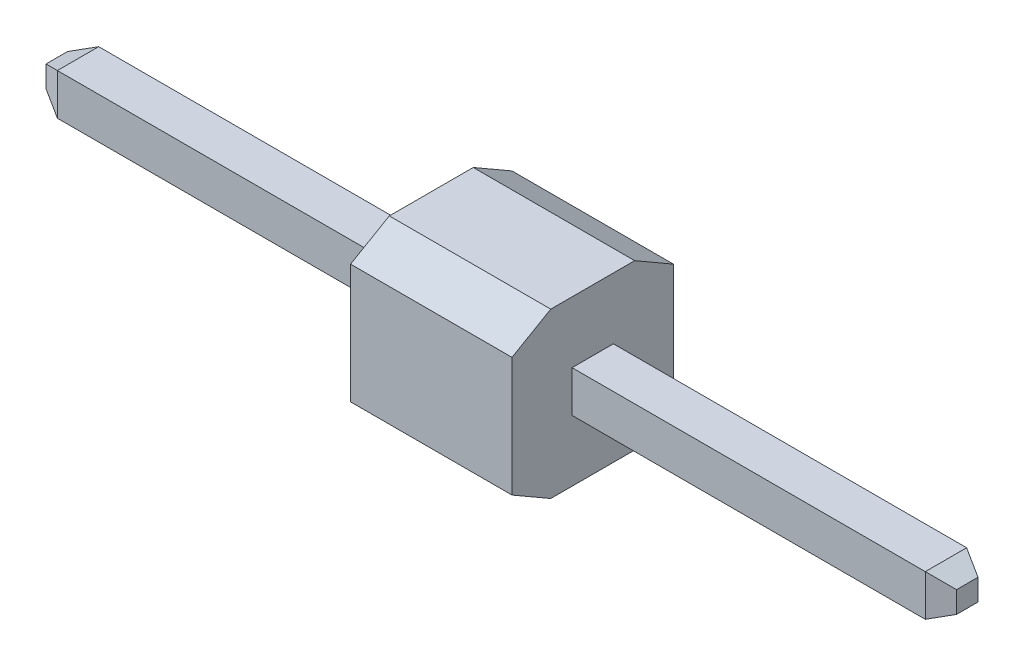
ISO-10303-21;
HEADER;
FILE_DESCRIPTION(('STEP AP214'),'2;1');
FILE_NAME('part.step','',(''),(''),'','','');
FILE_SCHEMA(('AUTOMOTIVE_DESIGN { 1 0 10303 214 1 1 1 1 }'));
ENDSEC;
DATA;
#1=APPLICATION_CONTEXT('core data for automotive mechanical design processes');
#2=APPLICATION_PROTOCOL_DEFINITION('international standard','automotive_design',2000,#1);
#3=PRODUCT_CONTEXT('',#1,'mechanical');
#4=PRODUCT('Part','Part','',(#3));
#5=PRODUCT_RELATED_PRODUCT_CATEGORY('part','',(#4));
#6=PRODUCT_DEFINITION_FORMATION('','',#4);
#7=PRODUCT_DEFINITION_CONTEXT('part definition',#1,'design');
#8=PRODUCT_DEFINITION('design','',#6,#7);
#9=PRODUCT_DEFINITION_SHAPE('','',#8);
#10=(LENGTH_UNIT() NAMED_UNIT(*) SI_UNIT(.MILLI.,.METRE.));
#11=(NAMED_UNIT(*) PLANE_ANGLE_UNIT() SI_UNIT($,.RADIAN.));
#12=(NAMED_UNIT(*) SI_UNIT($,.STERADIAN.) SOLID_ANGLE_UNIT());
#13=UNCERTAINTY_MEASURE_WITH_UNIT(LENGTH_MEASURE(1.E-05),#10,'distance_accuracy_value','');
#14=(GEOMETRIC_REPRESENTATION_CONTEXT(3) GLOBAL_UNCERTAINTY_ASSIGNED_CONTEXT((#13)) GLOBAL_UNIT_ASSIGNED_CONTEXT((#10,
#11,#12)) REPRESENTATION_CONTEXT('',''));
#15=CARTESIAN_POINT('',(0.,0.,0.));
#16=DIRECTION('',(0.,0.,1.));
#17=DIRECTION('',(1.,0.,0.));
#18=AXIS2_PLACEMENT_3D('',#15,#16,#17);
#19=CARTESIAN_POINT('',(5.42107516759986,-5.39712826291391,0.629998634255617));
#20=DIRECTION('',(1.,4.37113882867379E-08,-4.37113882867379E-08));
#21=DIRECTION('',(-4.37113882867379E-08,1.,0.));
#22=AXIS2_PLACEMENT_3D('',#19,#20,#21);
#23=PLANE('',#22);
#24=DIRECTION('',(1.59994777304464E-08,0.500000000000191,0.866025403784328));
#25=VECTOR('',#24,1.);
#26=CARTESIAN_POINT('',(5.42107504461394,-4.15353842442391,-0.940001365744382));
#27=LINE('',#26,#25);
#28=CARTESIAN_POINT('',(5.42107504461394,-4.15353842442391,-0.940001365744382));
#29=VERTEX_POINT('',#28);
#30=CARTESIAN_POINT('',(5.42107505569871,-3.80712826291392,-0.340001365744383));
#31=VERTEX_POINT('',#30);
#32=EDGE_CURVE('E11',#29,#31,#27,.T.);
#33=ORIENTED_EDGE('',*,*,#32,.T.);
#34=DIRECTION('',(4.37113886966664E-08,0.,0.999999999999999));
#35=VECTOR('',#34,1.);
#36=CARTESIAN_POINT('',(5.42107505569871,-3.80712826291392,-0.340001365744383));
#37=LINE('',#36,#35);
#38=CARTESIAN_POINT('',(5.42107511252351,-3.80712826291391,0.959998634255618));
#39=VERTEX_POINT('',#38);
#40=EDGE_CURVE('E304',#31,#39,#37,.T.);
#41=ORIENTED_EDGE('',*,*,#40,.T.);
#42=DIRECTION('',(5.97108668825762E-08,-0.500000000000186,0.866025403784329));
#43=VECTOR('',#42,1.);
#44=CARTESIAN_POINT('',(5.42107511252351,-3.80712826291391,0.959998634255618));
#45=LINE('',#44,#43);
#46=CARTESIAN_POINT('',(5.42107515389241,-4.15353842442391,1.55999863425562));
#47=VERTEX_POINT('',#46);
#48=EDGE_CURVE('E296',#39,#47,#45,.T.);
#49=ORIENTED_EDGE('',*,*,#48,.T.);
#50=DIRECTION('',(4.37113884815545E-08,-0.999999999999999,0.));
#51=VECTOR('',#50,1.);
#52=CARTESIAN_POINT('',(5.42107515389241,-4.15353842442391,1.55999863425562));
#53=LINE('',#52,#51);
#54=CARTESIAN_POINT('',(5.4210752346352,-6.00071810139391,1.55999863425562));
#55=VERTEX_POINT('',#54);
#56=EDGE_CURVE('E281',#47,#55,#53,.T.);
#57=ORIENTED_EDGE('',*,*,#56,.T.);
#58=DIRECTION('',(1.5999479012306E-08,0.500000000000191,0.866025403784328));
#59=VECTOR('',#58,1.);
#60=CARTESIAN_POINT('',(5.42107522355044,-6.34712826291391,0.959998634255618));
#61=LINE('',#60,#59);
#62=CARTESIAN_POINT('',(5.42107522355044,-6.34712826291391,0.959998634255618));
#63=VERTEX_POINT('',#62);
#64=EDGE_CURVE('E265',#63,#55,#61,.T.);
#65=ORIENTED_EDGE('',*,*,#64,.F.);
#66=DIRECTION('',(4.37113886966664E-08,0.,0.999999999999999));
#67=VECTOR('',#66,1.);
#68=CARTESIAN_POINT('',(5.42107516672563,-6.34712826291392,-0.340001365744383));
#69=LINE('',#68,#67);
#70=CARTESIAN_POINT('',(5.42107516672563,-6.34712826291392,-0.340001365744383));
#71=VERTEX_POINT('',#70);
#72=EDGE_CURVE('E248',#71,#63,#69,.T.);
#73=ORIENTED_EDGE('',*,*,#72,.F.);
#74=DIRECTION('',(5.97108656001698E-08,-0.50000000000019,0.866025403784327));
#75=VECTOR('',#74,1.);
#76=CARTESIAN_POINT('',(5.42107512535673,-6.00071810139391,-0.940001365744382));
#77=LINE('',#76,#75);
#78=CARTESIAN_POINT('',(5.42107512535673,-6.00071810139391,-0.940001365744382));
#79=VERTEX_POINT('',#78);
#80=EDGE_CURVE('E242',#79,#71,#77,.T.);
#81=ORIENTED_EDGE('',*,*,#80,.F.);
#82=DIRECTION('',(4.37113884815545E-08,-0.999999999999999,0.));
#83=VECTOR('',#82,1.);
#84=CARTESIAN_POINT('',(5.42107504461394,-4.15353842442391,-0.940001365744382));
#85=LINE('',#84,#83);
#86=EDGE_CURVE('E236',#29,#79,#85,.T.);
#87=ORIENTED_EDGE('',*,*,#86,.F.);
#88=EDGE_LOOP('',(#33,#41,#49,#57,#65,#73,#81,#87));
#89=FACE_BOUND('',#88,.T.);
#90=DIRECTION('',(-4.37113872875372E-08,0.,-0.999999999999999));
#91=VECTOR('',#90,1.);
#92=CARTESIAN_POINT('',(5.42107513962457,-4.75712826291391,0.629998634255617));
#93=LINE('',#92,#91);
#94=CARTESIAN_POINT('',(5.42107513962457,-4.75712826291391,0.629998634255617));
#95=VERTEX_POINT('',#94);
#96=CARTESIAN_POINT('',(5.42107511164928,-4.75712826291391,-0.0100013657443826));
#97=VERTEX_POINT('',#96);
#98=EDGE_CURVE('E302',#95,#97,#93,.T.);
#99=ORIENTED_EDGE('',*,*,#98,.T.);
#100=DIRECTION('',(-4.37113872875371E-08,0.999999999999999,0.));
#101=VECTOR('',#100,1.);
#102=CARTESIAN_POINT('',(5.42107513962457,-5.39712826291391,-0.0100013657443826));
#103=LINE('',#102,#101);
#104=CARTESIAN_POINT('',(5.42107513962457,-5.39712826291391,-0.0100013657443826));
#105=VERTEX_POINT('',#104);
#106=EDGE_CURVE('E293',#105,#97,#103,.T.);
#107=ORIENTED_EDGE('',*,*,#106,.F.);
#108=DIRECTION('',(-4.37113900630947E-08,0.,-0.999999999999999));
#109=VECTOR('',#108,1.);
#110=CARTESIAN_POINT('',(5.42107516759986,-5.39712826291391,0.629998634255617));
#111=LINE('',#110,#109);
#112=CARTESIAN_POINT('',(5.42107516759986,-5.39712826291391,0.629998634255617));
#113=VERTEX_POINT('',#112);
#114=EDGE_CURVE('E278',#113,#105,#111,.T.);
#115=ORIENTED_EDGE('',*,*,#114,.F.);
#116=DIRECTION('',(-4.37113900630947E-08,0.999999999999999,0.));
#117=VECTOR('',#116,1.);
#118=CARTESIAN_POINT('',(5.42107516759986,-5.39712826291391,0.629998634255617));
#119=LINE('',#118,#117);
#120=EDGE_CURVE('E263',#113,#95,#119,.T.);
#121=ORIENTED_EDGE('',*,*,#120,.T.);
#122=EDGE_LOOP('',(#99,#107,#115,#121));
#123=FACE_BOUND('',#122,.T.);
#124=ADVANCED_FACE('F17',(#89,#123),#23,.T.);
#125=CARTESIAN_POINT('',(2.92107516759986,-5.39712837219238,0.629998743534088));
#126=DIRECTION('',(1.,4.37113882867379E-08,-4.37113882867379E-08));
#127=DIRECTION('',(-4.37113882867379E-08,1.,0.));
#128=AXIS2_PLACEMENT_3D('',#125,#126,#127);
#129=PLANE('',#128);
#130=DIRECTION('',(1.59994783714339E-08,0.500000000000191,0.866025403784328));
#131=VECTOR('',#130,1.);
#132=CARTESIAN_POINT('',(2.92107504461394,-4.15353853370238,-0.940001256465912));
#133=LINE('',#132,#131);
#134=CARTESIAN_POINT('',(2.92107504461394,-4.15353853370238,-0.940001256465912));
#135=VERTEX_POINT('',#134);
#136=CARTESIAN_POINT('',(2.92107505569871,-3.80712837219239,-0.340001256465912));
#137=VERTEX_POINT('',#136);
#138=EDGE_CURVE('E24',#135,#137,#133,.T.);
#139=ORIENTED_EDGE('',*,*,#138,.F.);
#140=DIRECTION('',(4.37113882411397E-08,-0.999999999999999,0.));
#141=VECTOR('',#140,1.);
#142=CARTESIAN_POINT('',(2.92107504461394,-4.15353853370238,-0.940001256465912));
#143=LINE('',#142,#141);
#144=CARTESIAN_POINT('',(2.92107512535673,-6.00071821067239,-0.940001256465912));
#145=VERTEX_POINT('',#144);
#146=EDGE_CURVE('E300',#135,#145,#143,.T.);
#147=ORIENTED_EDGE('',*,*,#146,.T.);
#148=DIRECTION('',(5.97108668821449E-08,-0.50000000000019,0.866025403784327));
#149=VECTOR('',#148,1.);
#150=CARTESIAN_POINT('',(2.92107512535673,-6.00071821067239,-0.940001256465912));
#151=LINE('',#150,#149);
#152=CARTESIAN_POINT('',(2.92107516672563,-6.34712837219239,-0.340001256465912));
#153=VERTEX_POINT('',#152);
#154=EDGE_CURVE('E286',#145,#153,#151,.T.);
#155=ORIENTED_EDGE('',*,*,#154,.T.);
#156=DIRECTION('',(4.37113883550593E-08,0.,0.999999999999999));
#157=VECTOR('',#156,1.);
#158=CARTESIAN_POINT('',(2.92107516672563,-6.34712837219239,-0.340001256465912));
#159=LINE('',#158,#157);
#160=CARTESIAN_POINT('',(2.92107522355044,-6.34712837219238,0.959998743534088));
#161=VERTEX_POINT('',#160);
#162=EDGE_CURVE('E271',#153,#161,#159,.T.);
#163=ORIENTED_EDGE('',*,*,#162,.T.);
#164=DIRECTION('',(1.59994783713184E-08,0.500000000000191,0.866025403784328));
#165=VECTOR('',#164,1.);
#166=CARTESIAN_POINT('',(2.92107522355044,-6.34712837219238,0.959998743534088));
#167=LINE('',#166,#165);
#168=CARTESIAN_POINT('',(2.9210752346352,-6.00071821067238,1.55999874353409));
#169=VERTEX_POINT('',#168);
#170=EDGE_CURVE('E253',#161,#169,#167,.T.);
#171=ORIENTED_EDGE('',*,*,#170,.T.);
#172=DIRECTION('',(4.37113882411397E-08,-0.999999999999999,0.));
#173=VECTOR('',#172,1.);
#174=CARTESIAN_POINT('',(2.92107515389241,-4.15353853370238,1.55999874353409));
#175=LINE('',#174,#173);
#176=CARTESIAN_POINT('',(2.92107515389241,-4.15353853370238,1.55999874353409));
#177=VERTEX_POINT('',#176);
#178=EDGE_CURVE('E261',#177,#169,#175,.T.);
#179=ORIENTED_EDGE('',*,*,#178,.F.);
#180=DIRECTION('',(5.97108668825762E-08,-0.500000000000186,0.866025403784329));
#181=VECTOR('',#180,1.);
#182=CARTESIAN_POINT('',(2.92107511252351,-3.80712837219238,0.959998743534088));
#183=LINE('',#182,#181);
#184=CARTESIAN_POINT('',(2.92107511252351,-3.80712837219238,0.959998743534088));
#185=VERTEX_POINT('',#184);
#186=EDGE_CURVE('E276',#185,#177,#183,.T.);
#187=ORIENTED_EDGE('',*,*,#186,.F.);
#188=DIRECTION('',(4.37113883550593E-08,0.,0.999999999999999));
#189=VECTOR('',#188,1.);
#190=CARTESIAN_POINT('',(2.92107505569871,-3.80712837219239,-0.340001256465912));
#191=LINE('',#190,#189);
#192=EDGE_CURVE('E291',#137,#185,#191,.T.);
#193=ORIENTED_EDGE('',*,*,#192,.F.);
#194=EDGE_LOOP('',(#139,#147,#155,#163,#171,#179,#187,#193));
#195=FACE_BOUND('',#194,.T.);
#196=DIRECTION('',(-4.37113879814265E-08,0.999999999999999,0.));
#197=VECTOR('',#196,1.);
#198=CARTESIAN_POINT('',(2.92107513962457,-5.39712837219238,-0.0100012564659119));
#199=LINE('',#198,#197);
#200=CARTESIAN_POINT('',(2.92107513962457,-5.39712837219238,-0.0100012564659119));
#201=VERTEX_POINT('',#200);
#202=CARTESIAN_POINT('',(2.92107511164928,-4.75712837219238,-0.0100012564659119));
#203=VERTEX_POINT('',#202);
#204=EDGE_CURVE('E298',#201,#203,#199,.T.);
#205=ORIENTED_EDGE('',*,*,#204,.T.);
#206=DIRECTION('',(-4.37113879814266E-08,0.,-0.999999999999999));
#207=VECTOR('',#206,1.);
#208=CARTESIAN_POINT('',(2.92107513962457,-4.75712837219238,0.629998743534088));
#209=LINE('',#208,#207);
#210=CARTESIAN_POINT('',(2.92107513962457,-4.75712837219238,0.629998743534088));
#211=VERTEX_POINT('',#210);
#212=EDGE_CURVE('E283',#211,#203,#209,.T.);
#213=ORIENTED_EDGE('',*,*,#212,.F.);
#214=DIRECTION('',(-4.37113886753159E-08,0.999999999999999,0.));
#215=VECTOR('',#214,1.);
#216=CARTESIAN_POINT('',(2.92107516759986,-5.39712837219238,0.629998743534088));
#217=LINE('',#216,#215);
#218=CARTESIAN_POINT('',(2.92107516759986,-5.39712837219238,0.629998743534088));
#219=VERTEX_POINT('',#218);
#220=EDGE_CURVE('E268',#219,#211,#217,.T.);
#221=ORIENTED_EDGE('',*,*,#220,.F.);
#222=DIRECTION('',(-4.37113886753159E-08,0.,-0.999999999999999));
#223=VECTOR('',#222,1.);
#224=CARTESIAN_POINT('',(2.92107516759986,-5.39712837219238,0.629998743534088));
#225=LINE('',#224,#223);
#226=EDGE_CURVE('E251',#219,#201,#225,.T.);
#227=ORIENTED_EDGE('',*,*,#226,.T.);
#228=EDGE_LOOP('',(#205,#213,#221,#227));
#229=FACE_BOUND('',#228,.T.);
#230=ADVANCED_FACE('F314',(#195,#229),#129,.F.);
#231=CARTESIAN_POINT('',(5.42107504461394,-4.15353842442391,-0.940001365744382));
#232=DIRECTION('',(5.97108668343731E-08,-0.866025403784328,0.50000000000019));
#233=DIRECTION('',(-1.59994785476185E-08,-0.500000000000192,-0.866025403784329));
#234=AXIS2_PLACEMENT_3D('',#231,#232,#233);
#235=PLANE('',#234);
#236=ORIENTED_EDGE('',*,*,#138,.T.);
#237=DIRECTION('',(-0.999999999999998,-4.37113868656524E-08,4.37113883755557E-08));
#238=VECTOR('',#237,1.);
#239=CARTESIAN_POINT('',(5.42107505569871,-3.80712826291392,-0.340001365744383));
#240=LINE('',#239,#238);
#241=EDGE_CURVE('E288',#31,#137,#240,.T.);
#242=ORIENTED_EDGE('',*,*,#241,.F.);
#243=ORIENTED_EDGE('',*,*,#32,.F.);
#244=DIRECTION('',(-0.999999999999998,-4.37113868656524E-08,4.37113881091022E-08));
#245=VECTOR('',#244,1.);
#246=CARTESIAN_POINT('',(5.42107504461394,-4.15353842442391,-0.940001365744382));
#247=LINE('',#246,#245);
#248=EDGE_CURVE('E256',#29,#135,#247,.T.);
#249=ORIENTED_EDGE('',*,*,#248,.T.);
#250=EDGE_LOOP('',(#236,#242,#243,#249));
#251=FACE_BOUND('',#250,.T.);
#252=ADVANCED_FACE('F306',(#251),#235,.F.);
#253=CARTESIAN_POINT('',(5.42107505569871,-3.80712826291392,-0.340001365744383));
#254=DIRECTION('',(4.37113882867379E-08,-1.,0.));
#255=DIRECTION('',(1.,4.37113882867379E-08,-4.37113882867379E-08));
#256=AXIS2_PLACEMENT_3D('',#253,#254,#255);
#257=PLANE('',#256);
#258=ORIENTED_EDGE('',*,*,#192,.T.);
#259=DIRECTION('',(-0.999999999999998,-4.37113868656524E-08,4.37113882867378E-08));
#260=VECTOR('',#259,1.);
#261=CARTESIAN_POINT('',(5.42107511252351,-3.80712826291391,0.959998634255618));
#262=LINE('',#261,#260);
#263=EDGE_CURVE('E273',#39,#185,#262,.T.);
#264=ORIENTED_EDGE('',*,*,#263,.F.);
#265=ORIENTED_EDGE('',*,*,#40,.F.);
#266=ORIENTED_EDGE('',*,*,#241,.T.);
#267=EDGE_LOOP('',(#258,#264,#265,#266));
#268=FACE_BOUND('',#267,.T.);
#269=ADVANCED_FACE('F311',(#268),#257,.F.);
#270=CARTESIAN_POINT('',(5.42107511252351,-3.80712826291391,0.959998634255618));
#271=DIRECTION('',(1.59994785476185E-08,-0.86602540378433,-0.50000000000019));
#272=DIRECTION('',(-5.97108668343731E-08,0.500000000000188,-0.866025403784329));
#273=AXIS2_PLACEMENT_3D('',#270,#271,#272);
#274=PLANE('',#273);
#275=ORIENTED_EDGE('',*,*,#186,.T.);
#276=DIRECTION('',(-0.999999999999998,-4.37113868656524E-08,4.37113882867378E-08));
#277=VECTOR('',#276,1.);
#278=CARTESIAN_POINT('',(5.42107515389241,-4.15353842442391,1.55999863425562));
#279=LINE('',#278,#277);
#280=EDGE_CURVE('E258',#47,#177,#279,.T.);
#281=ORIENTED_EDGE('',*,*,#280,.F.);
#282=ORIENTED_EDGE('',*,*,#48,.F.);
#283=ORIENTED_EDGE('',*,*,#263,.T.);
#284=EDGE_LOOP('',(#275,#281,#282,#283));
#285=FACE_BOUND('',#284,.T.);
#286=ADVANCED_FACE('F319',(#285),#274,.F.);
#287=CARTESIAN_POINT('',(5.42107515389241,-4.15353842442391,1.55999863425562));
#288=DIRECTION('',(-4.37113882867379E-08,0.,-1.));
#289=DIRECTION('',(-1.,-4.37113882867379E-08,4.37113882867379E-08));
#290=AXIS2_PLACEMENT_3D('',#287,#288,#289);
#291=PLANE('',#290);
#292=ORIENTED_EDGE('',*,*,#178,.T.);
#293=DIRECTION('',(-0.999999999999998,-4.37113868656524E-08,4.37113882867378E-08));
#294=VECTOR('',#293,1.);
#295=CARTESIAN_POINT('',(5.4210752346352,-6.00071810139391,1.55999863425562));
#296=LINE('',#295,#294);
#297=EDGE_CURVE('E245',#55,#169,#296,.T.);
#298=ORIENTED_EDGE('',*,*,#297,.F.);
#299=ORIENTED_EDGE('',*,*,#56,.F.);
#300=ORIENTED_EDGE('',*,*,#280,.T.);
#301=EDGE_LOOP('',(#292,#298,#299,#300));
#302=FACE_BOUND('',#301,.T.);
#303=ADVANCED_FACE('F326',(#302),#291,.F.);
#304=CARTESIAN_POINT('',(5.42107522355044,-6.34712826291391,0.959998634255618));
#305=DIRECTION('',(5.97108668343731E-08,-0.866025403784328,0.50000000000019));
#306=DIRECTION('',(-1.59994785476185E-08,-0.500000000000192,-0.866025403784329));
#307=AXIS2_PLACEMENT_3D('',#304,#305,#306);
#308=PLANE('',#307);
#309=ORIENTED_EDGE('',*,*,#170,.F.);
#310=DIRECTION('',(-0.999999999999998,-4.37113897078233E-08,4.37113882867378E-08));
#311=VECTOR('',#310,1.);
#312=CARTESIAN_POINT('',(5.42107522355044,-6.34712826291391,0.959998634255618));
#313=LINE('',#312,#311);
#314=EDGE_CURVE('E239',#63,#161,#313,.T.);
#315=ORIENTED_EDGE('',*,*,#314,.F.);
#316=ORIENTED_EDGE('',*,*,#64,.T.);
#317=ORIENTED_EDGE('',*,*,#297,.T.);
#318=EDGE_LOOP('',(#309,#315,#316,#317));
#319=FACE_BOUND('',#318,.T.);
#320=ADVANCED_FACE('F329',(#319),#308,.T.);
#321=CARTESIAN_POINT('',(5.42107516672563,-6.34712826291392,-0.340001365744383));
#322=DIRECTION('',(4.37113882867379E-08,-1.,0.));
#323=DIRECTION('',(1.,4.37113882867379E-08,-4.37113882867379E-08));
#324=AXIS2_PLACEMENT_3D('',#321,#322,#323);
#325=PLANE('',#324);
#326=ORIENTED_EDGE('',*,*,#162,.F.);
#327=DIRECTION('',(-0.999999999999998,-4.37113897078233E-08,4.37113883755557E-08));
#328=VECTOR('',#327,1.);
#329=CARTESIAN_POINT('',(5.42107516672563,-6.34712826291392,-0.340001365744383));
#330=LINE('',#329,#328);
#331=EDGE_CURVE('E233',#71,#153,#330,.T.);
#332=ORIENTED_EDGE('',*,*,#331,.F.);
#333=ORIENTED_EDGE('',*,*,#72,.T.);
#334=ORIENTED_EDGE('',*,*,#314,.T.);
#335=EDGE_LOOP('',(#326,#332,#333,#334));
#336=FACE_BOUND('',#335,.T.);
#337=ADVANCED_FACE('F333',(#336),#325,.T.);
#338=CARTESIAN_POINT('',(5.42107512535673,-6.00071810139391,-0.940001365744382));
#339=DIRECTION('',(1.59994785476185E-08,-0.86602540378433,-0.50000000000019));
#340=DIRECTION('',(-5.97108668343731E-08,0.500000000000188,-0.866025403784329));
#341=AXIS2_PLACEMENT_3D('',#338,#339,#340);
#342=PLANE('',#341);
#343=ORIENTED_EDGE('',*,*,#154,.F.);
#344=DIRECTION('',(-0.999999999999998,-4.37113868656524E-08,4.37113881091021E-08));
#345=VECTOR('',#344,1.);
#346=CARTESIAN_POINT('',(5.42107512535673,-6.00071810139391,-0.940001365744382));
#347=LINE('',#346,#345);
#348=EDGE_CURVE('E230',#79,#145,#347,.T.);
#349=ORIENTED_EDGE('',*,*,#348,.F.);
#350=ORIENTED_EDGE('',*,*,#80,.T.);
#351=ORIENTED_EDGE('',*,*,#331,.T.);
#352=EDGE_LOOP('',(#343,#349,#350,#351));
#353=FACE_BOUND('',#352,.T.);
#354=ADVANCED_FACE('F337',(#353),#342,.T.);
#355=CARTESIAN_POINT('',(5.42107504461394,-4.15353842442391,-0.940001365744382));
#356=DIRECTION('',(-4.37113882867379E-08,0.,-1.));
#357=DIRECTION('',(-4.37113882867379E-08,1.,0.));
#358=AXIS2_PLACEMENT_3D('',#355,#356,#357);
#359=PLANE('',#358);
#360=ORIENTED_EDGE('',*,*,#146,.F.);
#361=ORIENTED_EDGE('',*,*,#248,.F.);
#362=ORIENTED_EDGE('',*,*,#86,.T.);
#363=ORIENTED_EDGE('',*,*,#348,.T.);
#364=EDGE_LOOP('',(#360,#361,#362,#363));
#365=FACE_BOUND('',#364,.T.);
#366=ADVANCED_FACE('F339',(#365),#359,.T.);
#367=CARTESIAN_POINT('',(-2.87892483240014,-5.39712862571844,0.62999899706014));
#368=DIRECTION('',(-1.,-4.37113882867379E-08,4.37113882867379E-08));
#369=DIRECTION('',(4.37113882867379E-08,-1.,0.));
#370=AXIS2_PLACEMENT_3D('',#367,#368,#369);
#371=PLANE('',#370);
#372=DIRECTION('',(4.37113874024238E-08,-0.999999999999999,0.));
#373=VECTOR('',#372,1.);
#374=CARTESIAN_POINT('',(-2.87892487489797,-4.91101015290844,0.14388052425114));
#375=LINE('',#374,#373);
#376=CARTESIAN_POINT('',(-2.87892487489797,-4.91101015290844,0.14388052425114));
#377=VERTEX_POINT('',#376);
#378=CARTESIAN_POINT('',(-2.87892486037543,-5.24324709851844,0.14388052425114));
#379=VERTEX_POINT('',#378);
#380=EDGE_CURVE('E228',#377,#379,#375,.T.);
#381=ORIENTED_EDGE('',*,*,#380,.T.);
#382=DIRECTION('',(4.37113874013716E-08,0.,0.999999999999999));
#383=VECTOR('',#382,1.);
#384=CARTESIAN_POINT('',(-2.87892486037543,-5.24324709851844,0.14388052425114));
#385=LINE('',#384,#383);
#386=CARTESIAN_POINT('',(-2.87892484585289,-5.24324709851844,0.47611746986914));
#387=VERTEX_POINT('',#386);
#388=EDGE_CURVE('E223',#379,#387,#385,.T.);
#389=ORIENTED_EDGE('',*,*,#388,.T.);
#390=DIRECTION('',(-4.37113900757521E-08,0.999999999999999,0.));
#391=VECTOR('',#390,1.);
#392=CARTESIAN_POINT('',(-2.87892484585289,-5.24324709851844,0.47611746986914));
#393=LINE('',#392,#391);
#394=CARTESIAN_POINT('',(-2.87892486037543,-4.91101015290844,0.47611746986914));
#395=VERTEX_POINT('',#394);
#396=EDGE_CURVE('E215',#387,#395,#393,.T.);
#397=ORIENTED_EDGE('',*,*,#396,.T.);
#398=DIRECTION('',(-4.37113847280434E-08,0.,-0.999999999999999));
#399=VECTOR('',#398,1.);
#400=CARTESIAN_POINT('',(-2.87892486037543,-4.91101015290843,0.47611746986914));
#401=LINE('',#400,#399);
#402=EDGE_CURVE('E207',#395,#377,#401,.T.);
#403=ORIENTED_EDGE('',*,*,#402,.T.);
#404=EDGE_LOOP('',(#381,#389,#397,#403));
#405=FACE_BOUND('',#404,.T.);
#406=ADVANCED_FACE('F341',(#405),#371,.T.);
#407=CARTESIAN_POINT('',(-2.87892483240014,-5.39712862571844,0.62999899706014));
#408=DIRECTION('',(4.37113882867379E-08,-1.,0.));
#409=DIRECTION('',(-4.37113882867379E-08,0.,-1.));
#410=AXIS2_PLACEMENT_3D('',#407,#408,#409);
#411=PLANE('',#410);
#412=DIRECTION('',(0.999999999999998,4.37113881958092E-08,-4.37113882769955E-08));
#413=VECTOR('',#412,1.);
#414=CARTESIAN_POINT('',(-2.54892483240014,-5.39712861129368,0.629998982635382));
#415=LINE('',#414,#413);
#416=CARTESIAN_POINT('',(-2.54892483240014,-5.39712861129368,0.629998982635382));
#417=VERTEX_POINT('',#416);
#418=EDGE_CURVE('E225',#417,#219,#415,.T.);
#419=ORIENTED_EDGE('',*,*,#418,.F.);
#420=DIRECTION('',(-4.37113872875372E-08,0.,-0.999999999999999));
#421=VECTOR('',#420,1.);
#422=CARTESIAN_POINT('',(-2.54892483240014,-5.39712861129368,0.629998982635382));
#423=LINE('',#422,#421);
#424=CARTESIAN_POINT('',(-2.54892486037543,-5.39712861129368,-0.010001017364618));
#425=VERTEX_POINT('',#424);
#426=EDGE_CURVE('E217',#417,#425,#423,.T.);
#427=ORIENTED_EDGE('',*,*,#426,.T.);
#428=DIRECTION('',(0.999999999999998,4.37113881958092E-08,-4.37113882161058E-08));
#429=VECTOR('',#428,1.);
#430=CARTESIAN_POINT('',(-2.54892486037543,-5.39712861129368,-0.010001017364618));
#431=LINE('',#430,#429);
#432=EDGE_CURVE('E220',#425,#201,#431,.T.);
#433=ORIENTED_EDGE('',*,*,#432,.T.);
#434=ORIENTED_EDGE('',*,*,#226,.F.);
#435=EDGE_LOOP('',(#419,#427,#433,#434));
#436=FACE_BOUND('',#435,.T.);
#437=ADVANCED_FACE('F348',(#436),#411,.T.);
#438=CARTESIAN_POINT('',(-2.87892486037543,-5.39712862571844,-0.0100010029398598));
#439=DIRECTION('',(-4.37113882867379E-08,0.,-1.));
#440=DIRECTION('',(-1.,-4.37113882867379E-08,4.37113882867379E-08));
#441=AXIS2_PLACEMENT_3D('',#438,#439,#440);
#442=PLANE('',#441);
#443=ORIENTED_EDGE('',*,*,#432,.F.);
#444=DIRECTION('',(-4.37113886753159E-08,0.999999999999999,0.));
#445=VECTOR('',#444,1.);
#446=CARTESIAN_POINT('',(-2.54892486037543,-5.39712861129368,-0.010001017364618));
#447=LINE('',#446,#445);
#448=CARTESIAN_POINT('',(-2.54892488835072,-4.75712861129368,-0.010001017364618));
#449=VERTEX_POINT('',#448);
#450=EDGE_CURVE('E209',#425,#449,#447,.T.);
#451=ORIENTED_EDGE('',*,*,#450,.T.);
#452=DIRECTION('',(0.999999999999998,4.37113881958092E-08,-4.37113882161057E-08));
#453=VECTOR('',#452,1.);
#454=CARTESIAN_POINT('',(-2.54892488835072,-4.75712861129368,-0.010001017364618));
#455=LINE('',#454,#453);
#456=EDGE_CURVE('E212',#449,#203,#455,.T.);
#457=ORIENTED_EDGE('',*,*,#456,.T.);
#458=ORIENTED_EDGE('',*,*,#204,.F.);
#459=EDGE_LOOP('',(#443,#451,#457,#458));
#460=FACE_BOUND('',#459,.T.);
#461=ADVANCED_FACE('F424',(#460),#442,.T.);
#462=CARTESIAN_POINT('',(-2.87892486037543,-4.75712862571844,0.62999899706014));
#463=DIRECTION('',(4.37113882867379E-08,-1.,0.));
#464=DIRECTION('',(-4.37113882867379E-08,0.,-1.));
#465=AXIS2_PLACEMENT_3D('',#462,#463,#464);
#466=PLANE('',#465);
#467=ORIENTED_EDGE('',*,*,#456,.F.);
#468=DIRECTION('',(4.37113900630947E-08,0.,0.999999999999999));
#469=VECTOR('',#468,1.);
#470=CARTESIAN_POINT('',(-2.54892488835072,-4.75712861129368,-0.010001017364618));
#471=LINE('',#470,#469);
#472=CARTESIAN_POINT('',(-2.54892486037543,-4.75712861129368,0.629998982635382));
#473=VERTEX_POINT('',#472);
#474=EDGE_CURVE('E201',#449,#473,#471,.T.);
#475=ORIENTED_EDGE('',*,*,#474,.T.);
#476=DIRECTION('',(0.999999999999998,4.37113881958092E-08,-4.37113882769955E-08));
#477=VECTOR('',#476,1.);
#478=CARTESIAN_POINT('',(-2.54892486037543,-4.75712861129368,0.629998982635382));
#479=LINE('',#478,#477);
#480=EDGE_CURVE('E204',#473,#211,#479,.T.);
#481=ORIENTED_EDGE('',*,*,#480,.T.);
#482=ORIENTED_EDGE('',*,*,#212,.T.);
#483=EDGE_LOOP('',(#467,#475,#481,#482));
#484=FACE_BOUND('',#483,.T.);
#485=ADVANCED_FACE('F421',(#484),#466,.F.);
#486=CARTESIAN_POINT('',(-2.87892483240014,-5.39712862571844,0.62999899706014));
#487=DIRECTION('',(-4.37113882867379E-08,0.,-1.));
#488=DIRECTION('',(-1.,-4.37113882867379E-08,4.37113882867379E-08));
#489=AXIS2_PLACEMENT_3D('',#486,#487,#488);
#490=PLANE('',#489);
#491=ORIENTED_EDGE('',*,*,#480,.F.);
#492=DIRECTION('',(4.37113858997583E-08,-0.999999999999999,0.));
#493=VECTOR('',#492,1.);
#494=CARTESIAN_POINT('',(-2.54892486037543,-4.75712861129368,0.629998982635382));
#495=LINE('',#494,#493);
#496=EDGE_CURVE('E196',#473,#417,#495,.T.);
#497=ORIENTED_EDGE('',*,*,#496,.T.);
#498=ORIENTED_EDGE('',*,*,#418,.T.);
#499=ORIENTED_EDGE('',*,*,#220,.T.);
#500=EDGE_LOOP('',(#491,#497,#498,#499));
#501=FACE_BOUND('',#500,.T.);
#502=ADVANCED_FACE('F376',(#501),#490,.F.);
#503=CARTESIAN_POINT('',(-2.87892483240014,-5.39712862571844,0.62999899706014));
#504=DIRECTION('',(-4.37113882867379E-08,0.,-1.));
#505=DIRECTION('',(-1.,-4.37113882867379E-08,4.37113882867379E-08));
#506=AXIS2_PLACEMENT_3D('',#503,#504,#505);
#507=PLANE('',#506);
#508=DIRECTION('',(0.999999999999998,4.37113881958092E-08,-4.37113882769955E-08));
#509=VECTOR('',#508,1.);
#510=CARTESIAN_POINT('',(5.42107516759986,-5.39712826291391,0.629998634255617));
#511=LINE('',#510,#509);
#512=CARTESIAN_POINT('',(10.8910751675999,-5.39712802381262,0.629998395154324));
#513=VERTEX_POINT('',#512);
#514=EDGE_CURVE('E199',#113,#513,#511,.T.);
#515=ORIENTED_EDGE('',*,*,#514,.T.);
#516=DIRECTION('',(-4.37113872875371E-08,0.999999999999999,0.));
#517=VECTOR('',#516,1.);
#518=CARTESIAN_POINT('',(10.8910751675999,-5.39712802381262,0.629998395154324));
#519=LINE('',#518,#517);
#520=CARTESIAN_POINT('',(10.8910751396246,-4.75712802381262,0.629998395154324));
#521=VERTEX_POINT('',#520);
#522=EDGE_CURVE('E191',#513,#521,#519,.T.);
#523=ORIENTED_EDGE('',*,*,#522,.T.);
#524=DIRECTION('',(0.999999999999998,4.37113933917341E-08,-4.37113882769955E-08));
#525=VECTOR('',#524,1.);
#526=CARTESIAN_POINT('',(5.42107513962457,-4.75712826291393,0.629998634255617));
#527=LINE('',#526,#525);
#528=EDGE_CURVE('E194',#95,#521,#527,.T.);
#529=ORIENTED_EDGE('',*,*,#528,.F.);
#530=ORIENTED_EDGE('',*,*,#120,.F.);
#531=EDGE_LOOP('',(#515,#523,#529,#530));
#532=FACE_BOUND('',#531,.T.);
#533=ADVANCED_FACE('F367',(#532),#507,.F.);
#534=CARTESIAN_POINT('',(-2.87892486037543,-4.75712862571844,0.62999899706014));
#535=DIRECTION('',(4.37113882867379E-08,-1.,0.));
#536=DIRECTION('',(-4.37113882867379E-08,0.,-1.));
#537=AXIS2_PLACEMENT_3D('',#534,#535,#536);
#538=PLANE('',#537);
#539=ORIENTED_EDGE('',*,*,#528,.T.);
#540=DIRECTION('',(-4.37113900630947E-08,0.,-0.999999999999999));
#541=VECTOR('',#540,1.);
#542=CARTESIAN_POINT('',(10.8910751396246,-4.75712802381262,0.629998395154324));
#543=LINE('',#542,#541);
#544=CARTESIAN_POINT('',(10.8910751116493,-4.75712802381262,-0.0100016048456765));
#545=VERTEX_POINT('',#544);
#546=EDGE_CURVE('E186',#521,#545,#543,.T.);
#547=ORIENTED_EDGE('',*,*,#546,.T.);
#548=DIRECTION('',(0.999999999999998,4.37113933917341E-08,-4.37113881146228E-08));
#549=VECTOR('',#548,1.);
#550=CARTESIAN_POINT('',(5.42107511164928,-4.75712826291393,-0.0100013657443823));
#551=LINE('',#550,#549);
#552=EDGE_CURVE('E189',#97,#545,#551,.T.);
#553=ORIENTED_EDGE('',*,*,#552,.F.);
#554=ORIENTED_EDGE('',*,*,#98,.F.);
#555=EDGE_LOOP('',(#539,#547,#553,#554));
#556=FACE_BOUND('',#555,.T.);
#557=ADVANCED_FACE('F364',(#556),#538,.F.);
#558=CARTESIAN_POINT('',(-2.87892486037543,-5.39712862571844,-0.0100010029398598));
#559=DIRECTION('',(-4.37113882867379E-08,0.,-1.));
#560=DIRECTION('',(-1.,-4.37113882867379E-08,4.37113882867379E-08));
#561=AXIS2_PLACEMENT_3D('',#558,#559,#560);
#562=PLANE('',#561);
#563=ORIENTED_EDGE('',*,*,#552,.T.);
#564=DIRECTION('',(4.37113900630947E-08,-0.999999999999999,0.));
#565=VECTOR('',#564,1.);
#566=CARTESIAN_POINT('',(10.8910751116493,-4.75712802381262,-0.0100016048456764));
#567=LINE('',#566,#565);
#568=CARTESIAN_POINT('',(10.8910751396246,-5.39712802381262,-0.0100016048456765));
#569=VERTEX_POINT('',#568);
#570=EDGE_CURVE('E176',#545,#569,#567,.T.);
#571=ORIENTED_EDGE('',*,*,#570,.T.);
#572=DIRECTION('',(0.999999999999998,4.37113881958092E-08,-4.37113881146228E-08));
#573=VECTOR('',#572,1.);
#574=CARTESIAN_POINT('',(5.42107513962457,-5.39712826291391,-0.0100013657443823));
#575=LINE('',#574,#573);
#576=EDGE_CURVE('E179',#105,#569,#575,.T.);
#577=ORIENTED_EDGE('',*,*,#576,.F.);
#578=ORIENTED_EDGE('',*,*,#106,.T.);
#579=EDGE_LOOP('',(#563,#571,#577,#578));
#580=FACE_BOUND('',#579,.T.);
#581=ADVANCED_FACE('F366',(#580),#562,.T.);
#582=CARTESIAN_POINT('',(-2.87892483240014,-5.39712862571844,0.62999899706014));
#583=DIRECTION('',(4.37113882867379E-08,-1.,0.));
#584=DIRECTION('',(-4.37113882867379E-08,0.,-1.));
#585=AXIS2_PLACEMENT_3D('',#582,#583,#584);
#586=PLANE('',#585);
#587=ORIENTED_EDGE('',*,*,#576,.T.);
#588=DIRECTION('',(4.37113872875372E-08,0.,0.999999999999999));
#589=VECTOR('',#588,1.);
#590=CARTESIAN_POINT('',(10.8910751396246,-5.39712802381262,-0.0100016048456765));
#591=LINE('',#590,#589);
#592=EDGE_CURVE('E167',#569,#513,#591,.T.);
#593=ORIENTED_EDGE('',*,*,#592,.T.);
#594=ORIENTED_EDGE('',*,*,#514,.F.);
#595=ORIENTED_EDGE('',*,*,#114,.T.);
#596=EDGE_LOOP('',(#587,#593,#594,#595));
#597=FACE_BOUND('',#596,.T.);
#598=ADVANCED_FACE('F373',(#597),#586,.T.);
#599=CARTESIAN_POINT('',(11.2210751675999,-5.39712800938786,0.629998380729565));
#600=DIRECTION('',(-1.,-4.37113882867379E-08,4.37113882867379E-08));
#601=DIRECTION('',(4.37113882867379E-08,-1.,0.));
#602=AXIS2_PLACEMENT_3D('',#599,#600,#601);
#603=PLANE('',#602);
#604=DIRECTION('',(-4.37113874024238E-08,0.999999999999999,0.));
#605=VECTOR('',#604,1.);
#606=CARTESIAN_POINT('',(11.2210751396246,-5.24324648218786,0.143879907920565));
#607=LINE('',#606,#605);
#608=CARTESIAN_POINT('',(11.2210751396246,-5.24324648218786,0.143879907920565));
#609=VERTEX_POINT('',#608);
#610=CARTESIAN_POINT('',(11.221075125102,-4.91100953657786,0.143879907920565));
#611=VERTEX_POINT('',#610);
#612=EDGE_CURVE('E153',#609,#611,#607,.T.);
#613=ORIENTED_EDGE('',*,*,#612,.T.);
#614=DIRECTION('',(4.37113874013716E-08,0.,0.999999999999999));
#615=VECTOR('',#614,1.);
#616=CARTESIAN_POINT('',(11.221075125102,-4.91100953657786,0.143879907920565));
#617=LINE('',#616,#615);
#618=CARTESIAN_POINT('',(11.2210751396246,-4.91100953657786,0.476116853538565));
#619=VERTEX_POINT('',#618);
#620=EDGE_CURVE('E395',#611,#619,#617,.T.);
#621=ORIENTED_EDGE('',*,*,#620,.T.);
#622=DIRECTION('',(4.37113927490803E-08,-0.999999999999999,0.));
#623=VECTOR('',#622,1.);
#624=CARTESIAN_POINT('',(11.2210751396246,-4.91100953657786,0.476116853538565));
#625=LINE('',#624,#623);
#626=CARTESIAN_POINT('',(11.2210751541471,-5.24324648218786,0.476116853538565));
#627=VERTEX_POINT('',#626);
#628=EDGE_CURVE('E156',#619,#627,#625,.T.);
#629=ORIENTED_EDGE('',*,*,#628,.T.);
#630=DIRECTION('',(-4.37113980946847E-08,0.,-0.999999999999999));
#631=VECTOR('',#630,1.);
#632=CARTESIAN_POINT('',(11.2210751541471,-5.24324648218786,0.476116853538565));
#633=LINE('',#632,#631);
#634=EDGE_CURVE('E149',#627,#609,#633,.T.);
#635=ORIENTED_EDGE('',*,*,#634,.T.);
#636=EDGE_LOOP('',(#613,#621,#629,#635));
#637=FACE_BOUND('',#636,.T.);
#638=ADVANCED_FACE('F151',(#637),#603,.F.);
#639=CARTESIAN_POINT('',(-2.87892485364905,-4.91101015290844,0.62999899706014));
#640=DIRECTION('',(-0.422618301356784,0.906307768563367,1.84732310895534E-08));
#641=DIRECTION('',(4.37113882867379E-08,0.,1.));
#642=AXIS2_PLACEMENT_3D('',#639,#640,#641);
#643=PLANE('',#642);
#644=DIRECTION('',(0.834817095446925,0.389281657126021,-0.389281657126018));
#645=VECTOR('',#644,1.);
#646=CARTESIAN_POINT('',(-2.87892487489798,-4.91101015290792,0.143880524251623));
#647=LINE('',#646,#645);
#648=EDGE_CURVE('E181',#377,#449,#647,.T.);
#649=ORIENTED_EDGE('',*,*,#648,.F.);
#650=ORIENTED_EDGE('',*,*,#402,.F.);
#651=DIRECTION('',(-0.834817129479003,-0.389281657126029,-0.389281584143985));
#652=VECTOR('',#651,1.);
#653=CARTESIAN_POINT('',(-2.54892486037586,-4.75712861129221,0.629998982634844));
#654=LINE('',#653,#652);
#655=EDGE_CURVE('E404',#473,#395,#654,.T.);
#656=ORIENTED_EDGE('',*,*,#655,.F.);
#657=ORIENTED_EDGE('',*,*,#474,.F.);
#658=EDGE_LOOP('',(#649,#650,#656,#657));
#659=FACE_BOUND('',#658,.T.);
#660=ADVANCED_FACE('F418',(#659),#643,.T.);
#661=CARTESIAN_POINT('',(-2.87892483912651,-5.39712862571844,0.47611746986914));
#662=DIRECTION('',(-0.422618222124841,-1.84732292043498E-08,0.906307805509828));
#663=DIRECTION('',(4.37113882867379E-08,-1.,0.));
#664=AXIS2_PLACEMENT_3D('',#661,#662,#663);
#665=PLANE('',#664);
#666=ORIENTED_EDGE('',*,*,#655,.T.);
#667=ORIENTED_EDGE('',*,*,#396,.F.);
#668=DIRECTION('',(-0.83481716351109,0.389281584143977,-0.389281584143989));
#669=VECTOR('',#668,1.);
#670=CARTESIAN_POINT('',(-2.54892483239899,-5.39712861129095,0.629998982635654));
#671=LINE('',#670,#669);
#672=EDGE_CURVE('E160',#417,#387,#671,.T.);
#673=ORIENTED_EDGE('',*,*,#672,.F.);
#674=ORIENTED_EDGE('',*,*,#496,.F.);
#675=EDGE_LOOP('',(#666,#667,#673,#674));
#676=FACE_BOUND('',#675,.T.);
#677=ADVANCED_FACE('F434',(#676),#665,.T.);
#678=CARTESIAN_POINT('',(-2.54892486037543,-5.39712861129368,-0.010001017364618));
#679=DIRECTION('',(0.422618301356784,1.8473232667688E-08,0.906307768563367));
#680=DIRECTION('',(-4.37113882867379E-08,1.,0.));
#681=AXIS2_PLACEMENT_3D('',#678,#679,#680);
#682=PLANE('',#681);
#683=ORIENTED_EDGE('',*,*,#648,.T.);
#684=ORIENTED_EDGE('',*,*,#450,.F.);
#685=DIRECTION('',(0.834817129479008,-0.389281584143985,-0.389281657126018));
#686=VECTOR('',#685,1.);
#687=CARTESIAN_POINT('',(-2.87892486037826,-5.24324709852598,0.1438805242526));
#688=LINE('',#687,#686);
#689=EDGE_CURVE('E170',#379,#425,#688,.T.);
#690=ORIENTED_EDGE('',*,*,#689,.F.);
#691=ORIENTED_EDGE('',*,*,#380,.F.);
#692=EDGE_LOOP('',(#683,#684,#690,#691));
#693=FACE_BOUND('',#692,.T.);
#694=ADVANCED_FACE('F413',(#693),#682,.F.);
#695=CARTESIAN_POINT('',(-2.54892483240014,-5.39712861129368,0.629998982635382));
#696=DIRECTION('',(0.422618222124841,0.906307805509828,-1.84732308250282E-08));
#697=DIRECTION('',(-4.37113882867379E-08,0.,-1.));
#698=AXIS2_PLACEMENT_3D('',#695,#696,#697);
#699=PLANE('',#698);
#700=ORIENTED_EDGE('',*,*,#672,.T.);
#701=ORIENTED_EDGE('',*,*,#388,.F.);
#702=ORIENTED_EDGE('',*,*,#689,.T.);
#703=ORIENTED_EDGE('',*,*,#426,.F.);
#704=EDGE_LOOP('',(#700,#701,#702,#703));
#705=FACE_BOUND('',#704,.T.);
#706=ADVANCED_FACE('F429',(#705),#699,.F.);
#707=CARTESIAN_POINT('',(11.2210751608735,-5.24324648218786,0.629998380729565));
#708=DIRECTION('',(0.422618301356784,-0.906307768563367,-1.84732310470096E-08));
#709=DIRECTION('',(4.37113882867379E-08,0.,1.));
#710=AXIS2_PLACEMENT_3D('',#707,#708,#709);
#711=PLANE('',#710);
#712=DIRECTION('',(-0.834817129479005,-0.389281657126024,-0.389281584143985));
#713=VECTOR('',#712,1.);
#714=CARTESIAN_POINT('',(11.2210751396246,-5.24324648218838,0.143879907921048));
#715=LINE('',#714,#713);
#716=EDGE_CURVE('E164',#609,#569,#715,.T.);
#717=ORIENTED_EDGE('',*,*,#716,.F.);
#718=ORIENTED_EDGE('',*,*,#634,.F.);
#719=DIRECTION('',(0.834817095446925,0.389281657126023,-0.389281657126017));
#720=VECTOR('',#719,1.);
#721=CARTESIAN_POINT('',(10.8910751675999,-5.39712802381262,0.629998395154324));
#722=LINE('',#721,#720);
#723=EDGE_CURVE('E392',#513,#627,#722,.T.);
#724=ORIENTED_EDGE('',*,*,#723,.F.);
#725=ORIENTED_EDGE('',*,*,#592,.F.);
#726=EDGE_LOOP('',(#717,#718,#724,#725));
#727=FACE_BOUND('',#726,.T.);
#728=ADVANCED_FACE('F165',(#727),#711,.T.);
#729=CARTESIAN_POINT('',(10.8910751675999,-5.39712802381262,0.629998395154324));
#730=DIRECTION('',(-0.422618301356784,-1.8473232667688E-08,-0.906307768563367));
#731=DIRECTION('',(-4.37113882867379E-08,1.,0.));
#732=AXIS2_PLACEMENT_3D('',#729,#730,#731);
#733=PLANE('',#732);
#734=ORIENTED_EDGE('',*,*,#723,.T.);
#735=ORIENTED_EDGE('',*,*,#628,.F.);
#736=DIRECTION('',(0.834817129479008,-0.389281584143983,-0.389281657126021));
#737=VECTOR('',#736,1.);
#738=CARTESIAN_POINT('',(10.8910751396261,-4.75712802380841,0.629998395153421));
#739=LINE('',#738,#737);
#740=EDGE_CURVE('E389',#521,#619,#739,.T.);
#741=ORIENTED_EDGE('',*,*,#740,.F.);
#742=ORIENTED_EDGE('',*,*,#522,.F.);
#743=EDGE_LOOP('',(#734,#735,#741,#742));
#744=FACE_BOUND('',#743,.T.);
#745=ADVANCED_FACE('F390',(#744),#733,.F.);
#746=CARTESIAN_POINT('',(11.2210751463509,-5.39712800938786,0.143879907920565));
#747=DIRECTION('',(0.422618222124841,1.84732292043498E-08,-0.906307805509828));
#748=DIRECTION('',(4.37113882867379E-08,-1.,0.));
#749=AXIS2_PLACEMENT_3D('',#746,#747,#748);
#750=PLANE('',#749);
#751=ORIENTED_EDGE('',*,*,#716,.T.);
#752=ORIENTED_EDGE('',*,*,#570,.F.);
#753=DIRECTION('',(-0.834817163511088,0.389281584143981,-0.389281584143988));
#754=VECTOR('',#753,1.);
#755=CARTESIAN_POINT('',(11.2210751251021,-4.91100953657734,0.143879907921048));
#756=LINE('',#755,#754);
#757=EDGE_CURVE('E175',#611,#545,#756,.T.);
#758=ORIENTED_EDGE('',*,*,#757,.F.);
#759=ORIENTED_EDGE('',*,*,#612,.F.);
#760=EDGE_LOOP('',(#751,#752,#758,#759));
#761=FACE_BOUND('',#760,.T.);
#762=ADVANCED_FACE('F173',(#761),#750,.T.);
#763=CARTESIAN_POINT('',(10.8910751396246,-4.75712802381262,0.629998395154324));
#764=DIRECTION('',(-0.422618222124841,-0.906307805509828,1.84732307824844E-08));
#765=DIRECTION('',(-4.37113882867379E-08,0.,-1.));
#766=AXIS2_PLACEMENT_3D('',#763,#764,#765);
#767=PLANE('',#766);
#768=ORIENTED_EDGE('',*,*,#740,.T.);
#769=ORIENTED_EDGE('',*,*,#620,.F.);
#770=ORIENTED_EDGE('',*,*,#757,.T.);
#771=ORIENTED_EDGE('',*,*,#546,.F.);
#772=EDGE_LOOP('',(#768,#769,#770,#771));
#773=FACE_BOUND('',#772,.T.);
#774=ADVANCED_FACE('F394',(#773),#767,.F.);
#775=CLOSED_SHELL('',(#124,#230,#252,#269,#286,#303,#320,#337,#354,#366,#406,#437,#461,#485,
#502,#533,#557,#581,#598,#638,#660,#677,#694,#706,#728,#745,#762,#774));
#776=MANIFOLD_SOLID_BREP('B1',#775);
#777=ADVANCED_BREP_SHAPE_REPRESENTATION('',(#18,#776),#14);
#778=SHAPE_DEFINITION_REPRESENTATION(#9,#777);
ENDSEC;
END-ISO-10303-21;
